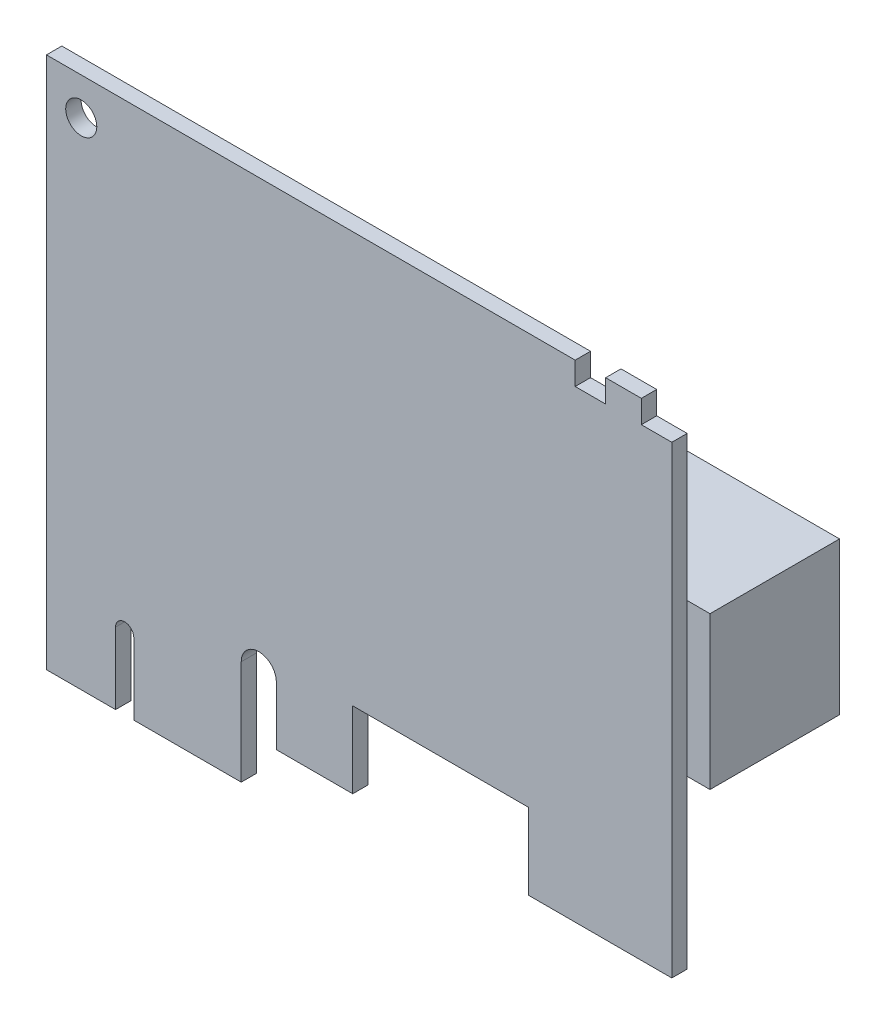
ISO-10303-21;
HEADER;
FILE_DESCRIPTION(('STEP AP214'),'2;1');
FILE_NAME('part.step','',(''),(''),'','','');
FILE_SCHEMA(('AUTOMOTIVE_DESIGN { 1 0 10303 214 1 1 1 1 }'));
ENDSEC;
DATA;
#1=APPLICATION_CONTEXT('core data for automotive mechanical design processes');
#2=APPLICATION_PROTOCOL_DEFINITION('international standard','automotive_design',2000,#1);
#3=PRODUCT_CONTEXT('',#1,'mechanical');
#4=PRODUCT('Part','Part','',(#3));
#5=PRODUCT_RELATED_PRODUCT_CATEGORY('part','',(#4));
#6=PRODUCT_DEFINITION_FORMATION('','',#4);
#7=PRODUCT_DEFINITION_CONTEXT('part definition',#1,'design');
#8=PRODUCT_DEFINITION('design','',#6,#7);
#9=PRODUCT_DEFINITION_SHAPE('','',#8);
#10=(LENGTH_UNIT() NAMED_UNIT(*) SI_UNIT(.MILLI.,.METRE.));
#11=(NAMED_UNIT(*) PLANE_ANGLE_UNIT() SI_UNIT($,.RADIAN.));
#12=(NAMED_UNIT(*) SI_UNIT($,.STERADIAN.) SOLID_ANGLE_UNIT());
#13=UNCERTAINTY_MEASURE_WITH_UNIT(LENGTH_MEASURE(1.E-05),#10,'distance_accuracy_value','');
#14=(GEOMETRIC_REPRESENTATION_CONTEXT(3) GLOBAL_UNCERTAINTY_ASSIGNED_CONTEXT((#13)) GLOBAL_UNIT_ASSIGNED_CONTEXT((#10,
#11,#12)) REPRESENTATION_CONTEXT('',''));
#15=CARTESIAN_POINT('',(0.,0.,0.));
#16=DIRECTION('',(0.,0.,1.));
#17=DIRECTION('',(1.,0.,0.));
#18=AXIS2_PLACEMENT_3D('',#15,#16,#17);
#19=CARTESIAN_POINT('',(22.1288,10.8712,0.));
#20=DIRECTION('',(0.,0.,1.));
#21=DIRECTION('',(1.,0.,0.));
#22=AXIS2_PLACEMENT_3D('',#19,#20,#21);
#23=PLANE('',#22);
#24=CARTESIAN_POINT('',(3.625,51.625,0.));
#25=DIRECTION('',(0.,0.,1.));
#26=DIRECTION('',(1.,0.,0.));
#27=AXIS2_PLACEMENT_3D('',#24,#25,#26);
#28=CIRCLE('',#27,1.61925);
#29=CARTESIAN_POINT('',(5.24425,51.625,0.));
#30=VERTEX_POINT('',#29);
#31=EDGE_CURVE('E241',#30,#30,#28,.T.);
#32=ORIENTED_EDGE('',*,*,#31,.T.);
#33=EDGE_LOOP('',(#32));
#34=FACE_BOUND('',#33,.T.);
#35=DIRECTION('',(1.,0.,0.));
#36=VECTOR('',#35,1.);
#37=CARTESIAN_POINT('',(67.55765,38.0375,0.));
#38=LINE('',#37,#36);
#39=CARTESIAN_POINT('',(45.33265,38.0375,0.));
#40=VERTEX_POINT('',#39);
#41=CARTESIAN_POINT('',(65.1764,38.0375,0.));
#42=VERTEX_POINT('',#41);
#43=EDGE_CURVE('E53',#40,#42,#38,.T.);
#44=ORIENTED_EDGE('',*,*,#43,.F.);
#45=DIRECTION('',(0.,1.,0.));
#46=VECTOR('',#45,1.);
#47=CARTESIAN_POINT('',(45.33265,38.0375,0.));
#48=LINE('',#47,#46);
#49=CARTESIAN_POINT('',(45.33265,22.1625,0.));
#50=VERTEX_POINT('',#49);
#51=EDGE_CURVE('E474',#50,#40,#48,.T.);
#52=ORIENTED_EDGE('',*,*,#51,.F.);
#53=DIRECTION('',(-1.,0.,0.));
#54=VECTOR('',#53,1.);
#55=CARTESIAN_POINT('',(67.55765,22.1625,0.));
#56=LINE('',#55,#54);
#57=CARTESIAN_POINT('',(65.1764,22.1625,0.));
#58=VERTEX_POINT('',#57);
#59=EDGE_CURVE('E11',#58,#50,#56,.T.);
#60=ORIENTED_EDGE('',*,*,#59,.F.);
#61=DIRECTION('',(0.,1.,0.));
#62=VECTOR('',#61,1.);
#63=CARTESIAN_POINT('',(65.1764,4.76250000000001,0.));
#64=LINE('',#63,#62);
#65=CARTESIAN_POINT('',(65.1764,4.76250000000001,0.));
#66=VERTEX_POINT('',#65);
#67=EDGE_CURVE('E328',#66,#58,#64,.T.);
#68=ORIENTED_EDGE('',*,*,#67,.F.);
#69=DIRECTION('',(1.,0.,0.));
#70=VECTOR('',#69,1.);
#71=CARTESIAN_POINT('',(50.2593,4.7625,0.));
#72=LINE('',#71,#70);
#73=CARTESIAN_POINT('',(50.2593,4.7625,0.));
#74=VERTEX_POINT('',#73);
#75=EDGE_CURVE('E326',#74,#66,#72,.T.);
#76=ORIENTED_EDGE('',*,*,#75,.F.);
#77=DIRECTION('',(0.,-1.,0.));
#78=VECTOR('',#77,1.);
#79=CARTESIAN_POINT('',(50.2593,4.7625,0.));
#80=LINE('',#79,#78);
#81=CARTESIAN_POINT('',(50.2593,12.7,0.));
#82=VERTEX_POINT('',#81);
#83=EDGE_CURVE('E324',#82,#74,#80,.T.);
#84=ORIENTED_EDGE('',*,*,#83,.F.);
#85=DIRECTION('',(1.,0.,0.));
#86=VECTOR('',#85,1.);
#87=CARTESIAN_POINT('',(31.9205,12.7,0.));
#88=LINE('',#87,#86);
#89=CARTESIAN_POINT('',(31.9205,12.7,0.));
#90=VERTEX_POINT('',#89);
#91=EDGE_CURVE('E322',#90,#82,#88,.T.);
#92=ORIENTED_EDGE('',*,*,#91,.F.);
#93=DIRECTION('',(0.,1.,0.));
#94=VECTOR('',#93,1.);
#95=CARTESIAN_POINT('',(31.9205,4.7625,0.));
#96=LINE('',#95,#94);
#97=CARTESIAN_POINT('',(31.9205,4.7625,0.));
#98=VERTEX_POINT('',#97);
#99=EDGE_CURVE('E320',#98,#90,#96,.T.);
#100=ORIENTED_EDGE('',*,*,#99,.F.);
#101=DIRECTION('',(1.,0.,0.));
#102=VECTOR('',#101,1.);
#103=CARTESIAN_POINT('',(31.9205,4.7625,0.));
#104=LINE('',#103,#102);
#105=CARTESIAN_POINT('',(23.9576,4.7625,0.));
#106=VERTEX_POINT('',#105);
#107=EDGE_CURVE('E318',#106,#98,#104,.T.);
#108=ORIENTED_EDGE('',*,*,#107,.F.);
#109=DIRECTION('',(0.,-1.,0.));
#110=VECTOR('',#109,1.);
#111=CARTESIAN_POINT('',(23.9576,4.7625,0.));
#112=LINE('',#111,#110);
#113=CARTESIAN_POINT('',(23.9576,10.8712,0.));
#114=VERTEX_POINT('',#113);
#115=EDGE_CURVE('E316',#114,#106,#112,.T.);
#116=ORIENTED_EDGE('',*,*,#115,.F.);
#117=CARTESIAN_POINT('',(22.1288,10.8712,0.));
#118=DIRECTION('',(0.,0.,-1.));
#119=DIRECTION('',(1.,0.,0.));
#120=AXIS2_PLACEMENT_3D('',#117,#118,#119);
#121=CIRCLE('',#120,1.8288);
#122=CARTESIAN_POINT('',(20.3,10.8712,0.));
#123=VERTEX_POINT('',#122);
#124=EDGE_CURVE('E314',#123,#114,#121,.T.);
#125=ORIENTED_EDGE('',*,*,#124,.F.);
#126=DIRECTION('',(0.,1.,0.));
#127=VECTOR('',#126,1.);
#128=CARTESIAN_POINT('',(20.3,0.,0.));
#129=LINE('',#128,#127);
#130=CARTESIAN_POINT('',(20.3,0.,0.));
#131=VERTEX_POINT('',#130);
#132=EDGE_CURVE('E312',#131,#123,#129,.T.);
#133=ORIENTED_EDGE('',*,*,#132,.F.);
#134=DIRECTION('',(1.,0.,0.));
#135=VECTOR('',#134,1.);
#136=CARTESIAN_POINT('',(9.1,0.,0.));
#137=LINE('',#136,#135);
#138=CARTESIAN_POINT('',(9.1,0.,0.));
#139=VERTEX_POINT('',#138);
#140=EDGE_CURVE('E310',#139,#131,#137,.T.);
#141=ORIENTED_EDGE('',*,*,#140,.F.);
#142=DIRECTION('',(0.,-1.,0.));
#143=VECTOR('',#142,1.);
#144=CARTESIAN_POINT('',(9.1,0.,0.));
#145=LINE('',#144,#143);
#146=CARTESIAN_POINT('',(9.1,7.45,0.));
#147=VERTEX_POINT('',#146);
#148=EDGE_CURVE('E308',#147,#139,#145,.T.);
#149=ORIENTED_EDGE('',*,*,#148,.F.);
#150=CARTESIAN_POINT('',(8.15,7.45,0.));
#151=DIRECTION('',(0.,0.,-1.));
#152=DIRECTION('',(1.,0.,0.));
#153=AXIS2_PLACEMENT_3D('',#150,#151,#152);
#154=CIRCLE('',#153,0.95);
#155=CARTESIAN_POINT('',(7.2,7.45,0.));
#156=VERTEX_POINT('',#155);
#157=EDGE_CURVE('E306',#156,#147,#154,.T.);
#158=ORIENTED_EDGE('',*,*,#157,.F.);
#159=DIRECTION('',(0.,1.,0.));
#160=VECTOR('',#159,1.);
#161=CARTESIAN_POINT('',(7.2,0.,0.));
#162=LINE('',#161,#160);
#163=CARTESIAN_POINT('',(7.2,0.,0.));
#164=VERTEX_POINT('',#163);
#165=EDGE_CURVE('E304',#164,#156,#162,.T.);
#166=ORIENTED_EDGE('',*,*,#165,.F.);
#167=DIRECTION('',(1.,0.,0.));
#168=VECTOR('',#167,1.);
#169=CARTESIAN_POINT('',(0.,0.,0.));
#170=LINE('',#169,#168);
#171=CARTESIAN_POINT('',(0.,0.,0.));
#172=VERTEX_POINT('',#171);
#173=EDGE_CURVE('E302',#172,#164,#170,.T.);
#174=ORIENTED_EDGE('',*,*,#173,.F.);
#175=DIRECTION('',(0.,-1.,0.));
#176=VECTOR('',#175,1.);
#177=CARTESIAN_POINT('',(0.,0.,0.));
#178=LINE('',#177,#176);
#179=CARTESIAN_POINT('',(0.,55.5,0.));
#180=VERTEX_POINT('',#179);
#181=EDGE_CURVE('E251',#180,#172,#178,.T.);
#182=ORIENTED_EDGE('',*,*,#181,.F.);
#183=DIRECTION('',(-1.,0.,0.));
#184=VECTOR('',#183,1.);
#185=CARTESIAN_POINT('',(0.,55.5,0.));
#186=LINE('',#185,#184);
#187=CARTESIAN_POINT('',(55.1064,55.5,0.));
#188=VERTEX_POINT('',#187);
#189=EDGE_CURVE('E257',#188,#180,#186,.T.);
#190=ORIENTED_EDGE('',*,*,#189,.F.);
#191=DIRECTION('',(0.,1.,0.));
#192=VECTOR('',#191,1.);
#193=CARTESIAN_POINT('',(55.1064,55.5,0.));
#194=LINE('',#193,#192);
#195=CARTESIAN_POINT('',(55.1064,53.11875,0.));
#196=VERTEX_POINT('',#195);
#197=EDGE_CURVE('E342',#196,#188,#194,.T.);
#198=ORIENTED_EDGE('',*,*,#197,.F.);
#199=DIRECTION('',(-1.,0.,0.));
#200=VECTOR('',#199,1.);
#201=CARTESIAN_POINT('',(55.1064,53.11875,0.));
#202=LINE('',#201,#200);
#203=CARTESIAN_POINT('',(58.2814,53.11875,0.));
#204=VERTEX_POINT('',#203);
#205=EDGE_CURVE('E340',#204,#196,#202,.T.);
#206=ORIENTED_EDGE('',*,*,#205,.F.);
#207=DIRECTION('',(0.,-1.,0.));
#208=VECTOR('',#207,1.);
#209=CARTESIAN_POINT('',(58.2814,55.5,0.));
#210=LINE('',#209,#208);
#211=CARTESIAN_POINT('',(58.2814,55.5,0.));
#212=VERTEX_POINT('',#211);
#213=EDGE_CURVE('E338',#212,#204,#210,.T.);
#214=ORIENTED_EDGE('',*,*,#213,.F.);
#215=DIRECTION('',(-1.,0.,0.));
#216=VECTOR('',#215,1.);
#217=CARTESIAN_POINT('',(58.2814,55.5,0.));
#218=LINE('',#217,#216);
#219=CARTESIAN_POINT('',(62.0014,55.5,0.));
#220=VERTEX_POINT('',#219);
#221=EDGE_CURVE('E336',#220,#212,#218,.T.);
#222=ORIENTED_EDGE('',*,*,#221,.F.);
#223=DIRECTION('',(0.,1.,0.));
#224=VECTOR('',#223,1.);
#225=CARTESIAN_POINT('',(62.0014,55.5,0.));
#226=LINE('',#225,#224);
#227=CARTESIAN_POINT('',(62.0014,53.11875,0.));
#228=VERTEX_POINT('',#227);
#229=EDGE_CURVE('E334',#228,#220,#226,.T.);
#230=ORIENTED_EDGE('',*,*,#229,.F.);
#231=DIRECTION('',(-1.,0.,0.));
#232=VECTOR('',#231,1.);
#233=CARTESIAN_POINT('',(62.0014,53.11875,0.));
#234=LINE('',#233,#232);
#235=CARTESIAN_POINT('',(65.1764,53.11875,0.));
#236=VERTEX_POINT('',#235);
#237=EDGE_CURVE('E331',#236,#228,#234,.T.);
#238=ORIENTED_EDGE('',*,*,#237,.F.);
#239=EDGE_CURVE('E58',#42,#236,#64,.T.);
#240=ORIENTED_EDGE('',*,*,#239,.F.);
#241=EDGE_LOOP('',(#44,#52,#60,#68,#76,#84,#92,#100,#108,#116,#125,#133,#141,#149,#158,#166,
#174,#182,#190,#198,#206,#214,#222,#230,#238,#240));
#242=FACE_BOUND('',#241,.T.);
#243=ADVANCED_FACE('F36',(#34,#242),#23,.F.);
#244=CARTESIAN_POINT('',(22.1288,10.8712,1.6));
#245=DIRECTION('',(0.,0.,1.));
#246=DIRECTION('',(1.,0.,0.));
#247=AXIS2_PLACEMENT_3D('',#244,#245,#246);
#248=PLANE('',#247);
#249=DIRECTION('',(0.,-1.,0.));
#250=VECTOR('',#249,1.);
#251=CARTESIAN_POINT('',(0.,0.,1.6));
#252=LINE('',#251,#250);
#253=CARTESIAN_POINT('',(0.,55.5,1.6));
#254=VERTEX_POINT('',#253);
#255=CARTESIAN_POINT('',(0.,0.,1.6));
#256=VERTEX_POINT('',#255);
#257=EDGE_CURVE('E253',#254,#256,#252,.T.);
#258=ORIENTED_EDGE('',*,*,#257,.T.);
#259=DIRECTION('',(1.,0.,0.));
#260=VECTOR('',#259,1.);
#261=CARTESIAN_POINT('',(0.,0.,1.6));
#262=LINE('',#261,#260);
#263=CARTESIAN_POINT('',(7.2,0.,1.6));
#264=VERTEX_POINT('',#263);
#265=EDGE_CURVE('E256',#256,#264,#262,.T.);
#266=ORIENTED_EDGE('',*,*,#265,.T.);
#267=DIRECTION('',(0.,1.,0.));
#268=VECTOR('',#267,1.);
#269=CARTESIAN_POINT('',(7.2,0.,1.6));
#270=LINE('',#269,#268);
#271=CARTESIAN_POINT('',(7.2,7.45,1.6));
#272=VERTEX_POINT('',#271);
#273=EDGE_CURVE('E259',#264,#272,#270,.T.);
#274=ORIENTED_EDGE('',*,*,#273,.T.);
#275=CARTESIAN_POINT('',(8.15,7.45,1.6));
#276=DIRECTION('',(0.,0.,-1.));
#277=DIRECTION('',(1.,0.,0.));
#278=AXIS2_PLACEMENT_3D('',#275,#276,#277);
#279=CIRCLE('',#278,0.95);
#280=CARTESIAN_POINT('',(9.1,7.45,1.6));
#281=VERTEX_POINT('',#280);
#282=EDGE_CURVE('E261',#272,#281,#279,.T.);
#283=ORIENTED_EDGE('',*,*,#282,.T.);
#284=DIRECTION('',(0.,-1.,0.));
#285=VECTOR('',#284,1.);
#286=CARTESIAN_POINT('',(9.1,0.,1.6));
#287=LINE('',#286,#285);
#288=CARTESIAN_POINT('',(9.1,0.,1.6));
#289=VERTEX_POINT('',#288);
#290=EDGE_CURVE('E263',#281,#289,#287,.T.);
#291=ORIENTED_EDGE('',*,*,#290,.T.);
#292=DIRECTION('',(1.,0.,0.));
#293=VECTOR('',#292,1.);
#294=CARTESIAN_POINT('',(9.1,0.,1.6));
#295=LINE('',#294,#293);
#296=CARTESIAN_POINT('',(20.3,0.,1.6));
#297=VERTEX_POINT('',#296);
#298=EDGE_CURVE('E265',#289,#297,#295,.T.);
#299=ORIENTED_EDGE('',*,*,#298,.T.);
#300=DIRECTION('',(0.,1.,0.));
#301=VECTOR('',#300,1.);
#302=CARTESIAN_POINT('',(20.3,0.,1.6));
#303=LINE('',#302,#301);
#304=CARTESIAN_POINT('',(20.3,10.8712,1.6));
#305=VERTEX_POINT('',#304);
#306=EDGE_CURVE('E267',#297,#305,#303,.T.);
#307=ORIENTED_EDGE('',*,*,#306,.T.);
#308=CARTESIAN_POINT('',(22.1288,10.8712,1.6));
#309=DIRECTION('',(0.,0.,-1.));
#310=DIRECTION('',(1.,0.,0.));
#311=AXIS2_PLACEMENT_3D('',#308,#309,#310);
#312=CIRCLE('',#311,1.8288);
#313=CARTESIAN_POINT('',(23.9576,10.8712,1.6));
#314=VERTEX_POINT('',#313);
#315=EDGE_CURVE('E269',#305,#314,#312,.T.);
#316=ORIENTED_EDGE('',*,*,#315,.T.);
#317=DIRECTION('',(0.,-1.,0.));
#318=VECTOR('',#317,1.);
#319=CARTESIAN_POINT('',(23.9576,4.7625,1.6));
#320=LINE('',#319,#318);
#321=CARTESIAN_POINT('',(23.9576,4.7625,1.6));
#322=VERTEX_POINT('',#321);
#323=EDGE_CURVE('E271',#314,#322,#320,.T.);
#324=ORIENTED_EDGE('',*,*,#323,.T.);
#325=DIRECTION('',(1.,0.,0.));
#326=VECTOR('',#325,1.);
#327=CARTESIAN_POINT('',(31.9205,4.7625,1.6));
#328=LINE('',#327,#326);
#329=CARTESIAN_POINT('',(31.9205,4.7625,1.6));
#330=VERTEX_POINT('',#329);
#331=EDGE_CURVE('E273',#322,#330,#328,.T.);
#332=ORIENTED_EDGE('',*,*,#331,.T.);
#333=DIRECTION('',(0.,1.,0.));
#334=VECTOR('',#333,1.);
#335=CARTESIAN_POINT('',(31.9205,4.7625,1.6));
#336=LINE('',#335,#334);
#337=CARTESIAN_POINT('',(31.9205,12.7,1.6));
#338=VERTEX_POINT('',#337);
#339=EDGE_CURVE('E275',#330,#338,#336,.T.);
#340=ORIENTED_EDGE('',*,*,#339,.T.);
#341=DIRECTION('',(1.,0.,0.));
#342=VECTOR('',#341,1.);
#343=CARTESIAN_POINT('',(31.9205,12.7,1.6));
#344=LINE('',#343,#342);
#345=CARTESIAN_POINT('',(50.2593,12.7,1.6));
#346=VERTEX_POINT('',#345);
#347=EDGE_CURVE('E277',#338,#346,#344,.T.);
#348=ORIENTED_EDGE('',*,*,#347,.T.);
#349=DIRECTION('',(0.,-1.,0.));
#350=VECTOR('',#349,1.);
#351=CARTESIAN_POINT('',(50.2593,4.7625,1.6));
#352=LINE('',#351,#350);
#353=CARTESIAN_POINT('',(50.2593,4.7625,1.6));
#354=VERTEX_POINT('',#353);
#355=EDGE_CURVE('E279',#346,#354,#352,.T.);
#356=ORIENTED_EDGE('',*,*,#355,.T.);
#357=DIRECTION('',(1.,0.,0.));
#358=VECTOR('',#357,1.);
#359=CARTESIAN_POINT('',(50.2593,4.7625,1.6));
#360=LINE('',#359,#358);
#361=CARTESIAN_POINT('',(65.1764,4.76250000000001,1.6));
#362=VERTEX_POINT('',#361);
#363=EDGE_CURVE('E281',#354,#362,#360,.T.);
#364=ORIENTED_EDGE('',*,*,#363,.T.);
#365=DIRECTION('',(0.,1.,0.));
#366=VECTOR('',#365,1.);
#367=CARTESIAN_POINT('',(65.1764,4.76250000000001,1.6));
#368=LINE('',#367,#366);
#369=CARTESIAN_POINT('',(65.1764,53.11875,1.6));
#370=VERTEX_POINT('',#369);
#371=EDGE_CURVE('E283',#362,#370,#368,.T.);
#372=ORIENTED_EDGE('',*,*,#371,.T.);
#373=DIRECTION('',(-1.,0.,0.));
#374=VECTOR('',#373,1.);
#375=CARTESIAN_POINT('',(62.0014,53.11875,1.6));
#376=LINE('',#375,#374);
#377=CARTESIAN_POINT('',(62.0014,53.11875,1.6));
#378=VERTEX_POINT('',#377);
#379=EDGE_CURVE('E285',#370,#378,#376,.T.);
#380=ORIENTED_EDGE('',*,*,#379,.T.);
#381=DIRECTION('',(0.,1.,0.));
#382=VECTOR('',#381,1.);
#383=CARTESIAN_POINT('',(62.0014,55.5,1.6));
#384=LINE('',#383,#382);
#385=CARTESIAN_POINT('',(62.0014,55.5,1.6));
#386=VERTEX_POINT('',#385);
#387=EDGE_CURVE('E287',#378,#386,#384,.T.);
#388=ORIENTED_EDGE('',*,*,#387,.T.);
#389=DIRECTION('',(-1.,0.,0.));
#390=VECTOR('',#389,1.);
#391=CARTESIAN_POINT('',(58.2814,55.5,1.6));
#392=LINE('',#391,#390);
#393=CARTESIAN_POINT('',(58.2814,55.5,1.6));
#394=VERTEX_POINT('',#393);
#395=EDGE_CURVE('E289',#386,#394,#392,.T.);
#396=ORIENTED_EDGE('',*,*,#395,.T.);
#397=DIRECTION('',(0.,-1.,0.));
#398=VECTOR('',#397,1.);
#399=CARTESIAN_POINT('',(58.2814,55.5,1.6));
#400=LINE('',#399,#398);
#401=CARTESIAN_POINT('',(58.2814,53.11875,1.6));
#402=VERTEX_POINT('',#401);
#403=EDGE_CURVE('E291',#394,#402,#400,.T.);
#404=ORIENTED_EDGE('',*,*,#403,.T.);
#405=DIRECTION('',(-1.,0.,0.));
#406=VECTOR('',#405,1.);
#407=CARTESIAN_POINT('',(55.1064,53.11875,1.6));
#408=LINE('',#407,#406);
#409=CARTESIAN_POINT('',(55.1064,53.11875,1.6));
#410=VERTEX_POINT('',#409);
#411=EDGE_CURVE('E293',#402,#410,#408,.T.);
#412=ORIENTED_EDGE('',*,*,#411,.T.);
#413=DIRECTION('',(0.,1.,0.));
#414=VECTOR('',#413,1.);
#415=CARTESIAN_POINT('',(55.1064,55.5,1.6));
#416=LINE('',#415,#414);
#417=CARTESIAN_POINT('',(55.1064,55.5,1.6));
#418=VERTEX_POINT('',#417);
#419=EDGE_CURVE('E295',#410,#418,#416,.T.);
#420=ORIENTED_EDGE('',*,*,#419,.T.);
#421=DIRECTION('',(-1.,0.,0.));
#422=VECTOR('',#421,1.);
#423=CARTESIAN_POINT('',(0.,55.5,1.6));
#424=LINE('',#423,#422);
#425=EDGE_CURVE('E297',#418,#254,#424,.T.);
#426=ORIENTED_EDGE('',*,*,#425,.T.);
#427=EDGE_LOOP('',(#258,#266,#274,#283,#291,#299,#307,#316,#324,#332,#340,#348,#356,#364,#372,
#380,#388,#396,#404,#412,#420,#426));
#428=FACE_BOUND('',#427,.T.);
#429=CARTESIAN_POINT('',(3.625,51.625,1.6));
#430=DIRECTION('',(0.,0.,1.));
#431=DIRECTION('',(1.,0.,0.));
#432=AXIS2_PLACEMENT_3D('',#429,#430,#431);
#433=CIRCLE('',#432,1.61925);
#434=CARTESIAN_POINT('',(5.24425,51.625,1.6));
#435=VERTEX_POINT('',#434);
#436=EDGE_CURVE('E244',#435,#435,#433,.T.);
#437=ORIENTED_EDGE('',*,*,#436,.F.);
#438=EDGE_LOOP('',(#437));
#439=FACE_BOUND('',#438,.T.);
#440=ADVANCED_FACE('F429',(#428,#439),#248,.T.);
#441=CARTESIAN_POINT('',(0.,0.,1.6));
#442=DIRECTION('',(1.,0.,0.));
#443=DIRECTION('',(0.,0.,-1.));
#444=AXIS2_PLACEMENT_3D('',#441,#442,#443);
#445=PLANE('',#444);
#446=ORIENTED_EDGE('',*,*,#181,.T.);
#447=DIRECTION('',(0.,0.,-1.));
#448=VECTOR('',#447,1.);
#449=CARTESIAN_POINT('',(0.,0.,1.6));
#450=LINE('',#449,#448);
#451=EDGE_CURVE('E40',#256,#172,#450,.T.);
#452=ORIENTED_EDGE('',*,*,#451,.F.);
#453=ORIENTED_EDGE('',*,*,#257,.F.);
#454=DIRECTION('',(0.,0.,-1.));
#455=VECTOR('',#454,1.);
#456=CARTESIAN_POINT('',(0.,55.5,1.6));
#457=LINE('',#456,#455);
#458=EDGE_CURVE('E299',#254,#180,#457,.T.);
#459=ORIENTED_EDGE('',*,*,#458,.T.);
#460=EDGE_LOOP('',(#446,#452,#453,#459));
#461=FACE_BOUND('',#460,.T.);
#462=ADVANCED_FACE('F38',(#461),#445,.F.);
#463=CARTESIAN_POINT('',(0.,0.,1.6));
#464=DIRECTION('',(0.,1.,0.));
#465=DIRECTION('',(0.,0.,1.));
#466=AXIS2_PLACEMENT_3D('',#463,#464,#465);
#467=PLANE('',#466);
#468=ORIENTED_EDGE('',*,*,#173,.T.);
#469=DIRECTION('',(0.,0.,-1.));
#470=VECTOR('',#469,1.);
#471=CARTESIAN_POINT('',(7.2,0.,1.6));
#472=LINE('',#471,#470);
#473=EDGE_CURVE('E403',#264,#164,#472,.T.);
#474=ORIENTED_EDGE('',*,*,#473,.F.);
#475=ORIENTED_EDGE('',*,*,#265,.F.);
#476=ORIENTED_EDGE('',*,*,#451,.T.);
#477=EDGE_LOOP('',(#468,#474,#475,#476));
#478=FACE_BOUND('',#477,.T.);
#479=ADVANCED_FACE('F412',(#478),#467,.F.);
#480=CARTESIAN_POINT('',(7.2,0.,1.6));
#481=DIRECTION('',(-1.,0.,0.));
#482=DIRECTION('',(0.,0.,1.));
#483=AXIS2_PLACEMENT_3D('',#480,#481,#482);
#484=PLANE('',#483);
#485=ORIENTED_EDGE('',*,*,#165,.T.);
#486=DIRECTION('',(0.,0.,-1.));
#487=VECTOR('',#486,1.);
#488=CARTESIAN_POINT('',(7.2,7.45,1.6));
#489=LINE('',#488,#487);
#490=EDGE_CURVE('E401',#272,#156,#489,.T.);
#491=ORIENTED_EDGE('',*,*,#490,.F.);
#492=ORIENTED_EDGE('',*,*,#273,.F.);
#493=ORIENTED_EDGE('',*,*,#473,.T.);
#494=EDGE_LOOP('',(#485,#491,#492,#493));
#495=FACE_BOUND('',#494,.T.);
#496=ADVANCED_FACE('F422',(#495),#484,.F.);
#497=CARTESIAN_POINT('',(8.15,7.45,1.6));
#498=DIRECTION('',(0.,0.,-1.));
#499=DIRECTION('',(-1.,0.,0.));
#500=AXIS2_PLACEMENT_3D('',#497,#498,#499);
#501=CYLINDRICAL_SURFACE('',#500,0.95);
#502=ORIENTED_EDGE('',*,*,#157,.T.);
#503=DIRECTION('',(0.,0.,-1.));
#504=VECTOR('',#503,1.);
#505=CARTESIAN_POINT('',(9.1,7.45,1.6));
#506=LINE('',#505,#504);
#507=EDGE_CURVE('E398',#281,#147,#506,.T.);
#508=ORIENTED_EDGE('',*,*,#507,.F.);
#509=ORIENTED_EDGE('',*,*,#282,.F.);
#510=ORIENTED_EDGE('',*,*,#490,.T.);
#511=EDGE_LOOP('',(#502,#508,#509,#510));
#512=FACE_BOUND('',#511,.T.);
#513=ADVANCED_FACE('F425',(#512),#501,.F.);
#514=CARTESIAN_POINT('',(9.1,0.,1.6));
#515=DIRECTION('',(1.,0.,0.));
#516=DIRECTION('',(0.,0.,-1.));
#517=AXIS2_PLACEMENT_3D('',#514,#515,#516);
#518=PLANE('',#517);
#519=ORIENTED_EDGE('',*,*,#148,.T.);
#520=DIRECTION('',(0.,0.,-1.));
#521=VECTOR('',#520,1.);
#522=CARTESIAN_POINT('',(9.1,0.,1.6));
#523=LINE('',#522,#521);
#524=EDGE_CURVE('E395',#289,#139,#523,.T.);
#525=ORIENTED_EDGE('',*,*,#524,.F.);
#526=ORIENTED_EDGE('',*,*,#290,.F.);
#527=ORIENTED_EDGE('',*,*,#507,.T.);
#528=EDGE_LOOP('',(#519,#525,#526,#527));
#529=FACE_BOUND('',#528,.T.);
#530=ADVANCED_FACE('F533',(#529),#518,.F.);
#531=CARTESIAN_POINT('',(9.1,0.,1.6));
#532=DIRECTION('',(0.,1.,0.));
#533=DIRECTION('',(0.,0.,1.));
#534=AXIS2_PLACEMENT_3D('',#531,#532,#533);
#535=PLANE('',#534);
#536=ORIENTED_EDGE('',*,*,#140,.T.);
#537=DIRECTION('',(0.,0.,-1.));
#538=VECTOR('',#537,1.);
#539=CARTESIAN_POINT('',(20.3,0.,1.6));
#540=LINE('',#539,#538);
#541=EDGE_CURVE('E392',#297,#131,#540,.T.);
#542=ORIENTED_EDGE('',*,*,#541,.F.);
#543=ORIENTED_EDGE('',*,*,#298,.F.);
#544=ORIENTED_EDGE('',*,*,#524,.T.);
#545=EDGE_LOOP('',(#536,#542,#543,#544));
#546=FACE_BOUND('',#545,.T.);
#547=ADVANCED_FACE('F531',(#546),#535,.F.);
#548=CARTESIAN_POINT('',(20.3,0.,1.6));
#549=DIRECTION('',(-1.,0.,0.));
#550=DIRECTION('',(0.,0.,1.));
#551=AXIS2_PLACEMENT_3D('',#548,#549,#550);
#552=PLANE('',#551);
#553=ORIENTED_EDGE('',*,*,#132,.T.);
#554=DIRECTION('',(0.,0.,-1.));
#555=VECTOR('',#554,1.);
#556=CARTESIAN_POINT('',(20.3,10.8712,1.6));
#557=LINE('',#556,#555);
#558=EDGE_CURVE('E389',#305,#123,#557,.T.);
#559=ORIENTED_EDGE('',*,*,#558,.F.);
#560=ORIENTED_EDGE('',*,*,#306,.F.);
#561=ORIENTED_EDGE('',*,*,#541,.T.);
#562=EDGE_LOOP('',(#553,#559,#560,#561));
#563=FACE_BOUND('',#562,.T.);
#564=ADVANCED_FACE('F527',(#563),#552,.F.);
#565=CARTESIAN_POINT('',(22.1288,10.8712,1.6));
#566=DIRECTION('',(0.,0.,-1.));
#567=DIRECTION('',(-1.,0.,0.));
#568=AXIS2_PLACEMENT_3D('',#565,#566,#567);
#569=CYLINDRICAL_SURFACE('',#568,1.8288);
#570=ORIENTED_EDGE('',*,*,#124,.T.);
#571=DIRECTION('',(0.,0.,-1.));
#572=VECTOR('',#571,1.);
#573=CARTESIAN_POINT('',(23.9576,10.8712,1.6));
#574=LINE('',#573,#572);
#575=EDGE_CURVE('E386',#314,#114,#574,.T.);
#576=ORIENTED_EDGE('',*,*,#575,.F.);
#577=ORIENTED_EDGE('',*,*,#315,.F.);
#578=ORIENTED_EDGE('',*,*,#558,.T.);
#579=EDGE_LOOP('',(#570,#576,#577,#578));
#580=FACE_BOUND('',#579,.T.);
#581=ADVANCED_FACE('F522',(#580),#569,.F.);
#582=CARTESIAN_POINT('',(23.9576,4.7625,1.6));
#583=DIRECTION('',(1.,0.,0.));
#584=DIRECTION('',(0.,1.,0.));
#585=AXIS2_PLACEMENT_3D('',#582,#583,#584);
#586=PLANE('',#585);
#587=ORIENTED_EDGE('',*,*,#115,.T.);
#588=DIRECTION('',(0.,0.,-1.));
#589=VECTOR('',#588,1.);
#590=CARTESIAN_POINT('',(23.9576,4.7625,1.6));
#591=LINE('',#590,#589);
#592=EDGE_CURVE('E383',#322,#106,#591,.T.);
#593=ORIENTED_EDGE('',*,*,#592,.F.);
#594=ORIENTED_EDGE('',*,*,#323,.F.);
#595=ORIENTED_EDGE('',*,*,#575,.T.);
#596=EDGE_LOOP('',(#587,#593,#594,#595));
#597=FACE_BOUND('',#596,.T.);
#598=ADVANCED_FACE('F516',(#597),#586,.F.);
#599=CARTESIAN_POINT('',(31.9205,4.7625,1.6));
#600=DIRECTION('',(0.,1.,0.));
#601=DIRECTION('',(-1.,0.,0.));
#602=AXIS2_PLACEMENT_3D('',#599,#600,#601);
#603=PLANE('',#602);
#604=ORIENTED_EDGE('',*,*,#107,.T.);
#605=DIRECTION('',(0.,0.,-1.));
#606=VECTOR('',#605,1.);
#607=CARTESIAN_POINT('',(31.9205,4.7625,1.6));
#608=LINE('',#607,#606);
#609=EDGE_CURVE('E380',#330,#98,#608,.T.);
#610=ORIENTED_EDGE('',*,*,#609,.F.);
#611=ORIENTED_EDGE('',*,*,#331,.F.);
#612=ORIENTED_EDGE('',*,*,#592,.T.);
#613=EDGE_LOOP('',(#604,#610,#611,#612));
#614=FACE_BOUND('',#613,.T.);
#615=ADVANCED_FACE('F512',(#614),#603,.F.);
#616=CARTESIAN_POINT('',(31.9205,4.7625,1.6));
#617=DIRECTION('',(-1.,0.,0.));
#618=DIRECTION('',(0.,0.,1.));
#619=AXIS2_PLACEMENT_3D('',#616,#617,#618);
#620=PLANE('',#619);
#621=ORIENTED_EDGE('',*,*,#99,.T.);
#622=DIRECTION('',(0.,0.,-1.));
#623=VECTOR('',#622,1.);
#624=CARTESIAN_POINT('',(31.9205,12.7,1.6));
#625=LINE('',#624,#623);
#626=EDGE_CURVE('E377',#338,#90,#625,.T.);
#627=ORIENTED_EDGE('',*,*,#626,.F.);
#628=ORIENTED_EDGE('',*,*,#339,.F.);
#629=ORIENTED_EDGE('',*,*,#609,.T.);
#630=EDGE_LOOP('',(#621,#627,#628,#629));
#631=FACE_BOUND('',#630,.T.);
#632=ADVANCED_FACE('F507',(#631),#620,.F.);
#633=CARTESIAN_POINT('',(31.9205,12.7,1.6));
#634=DIRECTION('',(0.,1.,0.));
#635=DIRECTION('',(0.,0.,1.));
#636=AXIS2_PLACEMENT_3D('',#633,#634,#635);
#637=PLANE('',#636);
#638=ORIENTED_EDGE('',*,*,#91,.T.);
#639=DIRECTION('',(0.,0.,-1.));
#640=VECTOR('',#639,1.);
#641=CARTESIAN_POINT('',(50.2593,12.7,1.6));
#642=LINE('',#641,#640);
#643=EDGE_CURVE('E374',#346,#82,#642,.T.);
#644=ORIENTED_EDGE('',*,*,#643,.F.);
#645=ORIENTED_EDGE('',*,*,#347,.F.);
#646=ORIENTED_EDGE('',*,*,#626,.T.);
#647=EDGE_LOOP('',(#638,#644,#645,#646));
#648=FACE_BOUND('',#647,.T.);
#649=ADVANCED_FACE('F501',(#648),#637,.F.);
#650=CARTESIAN_POINT('',(50.2593,4.7625,1.6));
#651=DIRECTION('',(1.,0.,0.));
#652=DIRECTION('',(0.,0.,-1.));
#653=AXIS2_PLACEMENT_3D('',#650,#651,#652);
#654=PLANE('',#653);
#655=ORIENTED_EDGE('',*,*,#83,.T.);
#656=DIRECTION('',(0.,0.,-1.));
#657=VECTOR('',#656,1.);
#658=CARTESIAN_POINT('',(50.2593,4.7625,1.6));
#659=LINE('',#658,#657);
#660=EDGE_CURVE('E371',#354,#74,#659,.T.);
#661=ORIENTED_EDGE('',*,*,#660,.F.);
#662=ORIENTED_EDGE('',*,*,#355,.F.);
#663=ORIENTED_EDGE('',*,*,#643,.T.);
#664=EDGE_LOOP('',(#655,#661,#662,#663));
#665=FACE_BOUND('',#664,.T.);
#666=ADVANCED_FACE('F497',(#665),#654,.F.);
#667=CARTESIAN_POINT('',(50.2593,4.7625,1.6));
#668=DIRECTION('',(0.,1.,0.));
#669=DIRECTION('',(-1.,0.,0.));
#670=AXIS2_PLACEMENT_3D('',#667,#668,#669);
#671=PLANE('',#670);
#672=ORIENTED_EDGE('',*,*,#75,.T.);
#673=DIRECTION('',(0.,0.,-1.));
#674=VECTOR('',#673,1.);
#675=CARTESIAN_POINT('',(65.1764,4.76250000000001,1.6));
#676=LINE('',#675,#674);
#677=EDGE_CURVE('E368',#362,#66,#676,.T.);
#678=ORIENTED_EDGE('',*,*,#677,.F.);
#679=ORIENTED_EDGE('',*,*,#363,.F.);
#680=ORIENTED_EDGE('',*,*,#660,.T.);
#681=EDGE_LOOP('',(#672,#678,#679,#680));
#682=FACE_BOUND('',#681,.T.);
#683=ADVANCED_FACE('F492',(#682),#671,.F.);
#684=CARTESIAN_POINT('',(65.1764,4.76250000000001,1.6));
#685=DIRECTION('',(-1.,0.,0.));
#686=DIRECTION('',(0.,0.,1.));
#687=AXIS2_PLACEMENT_3D('',#684,#685,#686);
#688=PLANE('',#687);
#689=ORIENTED_EDGE('',*,*,#67,.T.);
#690=EDGE_CURVE('E332',#58,#42,#64,.T.);
#691=ORIENTED_EDGE('',*,*,#690,.T.);
#692=ORIENTED_EDGE('',*,*,#239,.T.);
#693=DIRECTION('',(0.,0.,-1.));
#694=VECTOR('',#693,1.);
#695=CARTESIAN_POINT('',(65.1764,53.11875,1.6));
#696=LINE('',#695,#694);
#697=EDGE_CURVE('E365',#370,#236,#696,.T.);
#698=ORIENTED_EDGE('',*,*,#697,.F.);
#699=ORIENTED_EDGE('',*,*,#371,.F.);
#700=ORIENTED_EDGE('',*,*,#677,.T.);
#701=EDGE_LOOP('',(#689,#691,#692,#698,#699,#700));
#702=FACE_BOUND('',#701,.T.);
#703=ADVANCED_FACE('F466',(#702),#688,.F.);
#704=CARTESIAN_POINT('',(62.0014,53.11875,1.6));
#705=DIRECTION('',(0.,-1.,0.));
#706=DIRECTION('',(0.,0.,-1.));
#707=AXIS2_PLACEMENT_3D('',#704,#705,#706);
#708=PLANE('',#707);
#709=ORIENTED_EDGE('',*,*,#237,.T.);
#710=DIRECTION('',(0.,0.,-1.));
#711=VECTOR('',#710,1.);
#712=CARTESIAN_POINT('',(62.0014,53.11875,1.6));
#713=LINE('',#712,#711);
#714=EDGE_CURVE('E362',#378,#228,#713,.T.);
#715=ORIENTED_EDGE('',*,*,#714,.F.);
#716=ORIENTED_EDGE('',*,*,#379,.F.);
#717=ORIENTED_EDGE('',*,*,#697,.T.);
#718=EDGE_LOOP('',(#709,#715,#716,#717));
#719=FACE_BOUND('',#718,.T.);
#720=ADVANCED_FACE('F462',(#719),#708,.F.);
#721=CARTESIAN_POINT('',(62.0014,55.5,1.6));
#722=DIRECTION('',(-1.,0.,0.));
#723=DIRECTION('',(0.,0.,1.));
#724=AXIS2_PLACEMENT_3D('',#721,#722,#723);
#725=PLANE('',#724);
#726=ORIENTED_EDGE('',*,*,#229,.T.);
#727=DIRECTION('',(0.,0.,-1.));
#728=VECTOR('',#727,1.);
#729=CARTESIAN_POINT('',(62.0014,55.5,1.6));
#730=LINE('',#729,#728);
#731=EDGE_CURVE('E359',#386,#220,#730,.T.);
#732=ORIENTED_EDGE('',*,*,#731,.F.);
#733=ORIENTED_EDGE('',*,*,#387,.F.);
#734=ORIENTED_EDGE('',*,*,#714,.T.);
#735=EDGE_LOOP('',(#726,#732,#733,#734));
#736=FACE_BOUND('',#735,.T.);
#737=ADVANCED_FACE('F457',(#736),#725,.F.);
#738=CARTESIAN_POINT('',(58.2814,55.5,1.6));
#739=DIRECTION('',(0.,-1.,0.));
#740=DIRECTION('',(0.,0.,-1.));
#741=AXIS2_PLACEMENT_3D('',#738,#739,#740);
#742=PLANE('',#741);
#743=ORIENTED_EDGE('',*,*,#221,.T.);
#744=DIRECTION('',(0.,0.,-1.));
#745=VECTOR('',#744,1.);
#746=CARTESIAN_POINT('',(58.2814,55.5,1.6));
#747=LINE('',#746,#745);
#748=EDGE_CURVE('E356',#394,#212,#747,.T.);
#749=ORIENTED_EDGE('',*,*,#748,.F.);
#750=ORIENTED_EDGE('',*,*,#395,.F.);
#751=ORIENTED_EDGE('',*,*,#731,.T.);
#752=EDGE_LOOP('',(#743,#749,#750,#751));
#753=FACE_BOUND('',#752,.T.);
#754=ADVANCED_FACE('F453',(#753),#742,.F.);
#755=CARTESIAN_POINT('',(58.2814,55.5,1.6));
#756=DIRECTION('',(1.,0.,0.));
#757=DIRECTION('',(0.,0.,-1.));
#758=AXIS2_PLACEMENT_3D('',#755,#756,#757);
#759=PLANE('',#758);
#760=ORIENTED_EDGE('',*,*,#213,.T.);
#761=DIRECTION('',(0.,0.,-1.));
#762=VECTOR('',#761,1.);
#763=CARTESIAN_POINT('',(58.2814,53.11875,1.6));
#764=LINE('',#763,#762);
#765=EDGE_CURVE('E353',#402,#204,#764,.T.);
#766=ORIENTED_EDGE('',*,*,#765,.F.);
#767=ORIENTED_EDGE('',*,*,#403,.F.);
#768=ORIENTED_EDGE('',*,*,#748,.T.);
#769=EDGE_LOOP('',(#760,#766,#767,#768));
#770=FACE_BOUND('',#769,.T.);
#771=ADVANCED_FACE('F449',(#770),#759,.F.);
#772=CARTESIAN_POINT('',(55.1064,53.11875,1.6));
#773=DIRECTION('',(0.,-1.,0.));
#774=DIRECTION('',(0.,0.,-1.));
#775=AXIS2_PLACEMENT_3D('',#772,#773,#774);
#776=PLANE('',#775);
#777=ORIENTED_EDGE('',*,*,#205,.T.);
#778=DIRECTION('',(0.,0.,-1.));
#779=VECTOR('',#778,1.);
#780=CARTESIAN_POINT('',(55.1064,53.11875,1.6));
#781=LINE('',#780,#779);
#782=EDGE_CURVE('E350',#410,#196,#781,.T.);
#783=ORIENTED_EDGE('',*,*,#782,.F.);
#784=ORIENTED_EDGE('',*,*,#411,.F.);
#785=ORIENTED_EDGE('',*,*,#765,.T.);
#786=EDGE_LOOP('',(#777,#783,#784,#785));
#787=FACE_BOUND('',#786,.T.);
#788=ADVANCED_FACE('F444',(#787),#776,.F.);
#789=CARTESIAN_POINT('',(55.1064,55.5,1.6));
#790=DIRECTION('',(-1.,0.,0.));
#791=DIRECTION('',(0.,0.,1.));
#792=AXIS2_PLACEMENT_3D('',#789,#790,#791);
#793=PLANE('',#792);
#794=ORIENTED_EDGE('',*,*,#197,.T.);
#795=DIRECTION('',(0.,0.,-1.));
#796=VECTOR('',#795,1.);
#797=CARTESIAN_POINT('',(55.1064,55.5,1.6));
#798=LINE('',#797,#796);
#799=EDGE_CURVE('E347',#418,#188,#798,.T.);
#800=ORIENTED_EDGE('',*,*,#799,.F.);
#801=ORIENTED_EDGE('',*,*,#419,.F.);
#802=ORIENTED_EDGE('',*,*,#782,.T.);
#803=EDGE_LOOP('',(#794,#800,#801,#802));
#804=FACE_BOUND('',#803,.T.);
#805=ADVANCED_FACE('F438',(#804),#793,.F.);
#806=CARTESIAN_POINT('',(0.,55.5,1.6));
#807=DIRECTION('',(0.,-1.,0.));
#808=DIRECTION('',(0.,0.,-1.));
#809=AXIS2_PLACEMENT_3D('',#806,#807,#808);
#810=PLANE('',#809);
#811=ORIENTED_EDGE('',*,*,#189,.T.);
#812=ORIENTED_EDGE('',*,*,#458,.F.);
#813=ORIENTED_EDGE('',*,*,#425,.F.);
#814=ORIENTED_EDGE('',*,*,#799,.T.);
#815=EDGE_LOOP('',(#811,#812,#813,#814));
#816=FACE_BOUND('',#815,.T.);
#817=ADVANCED_FACE('F436',(#816),#810,.F.);
#818=CARTESIAN_POINT('',(3.625,51.625,1.6));
#819=DIRECTION('',(0.,0.,-1.));
#820=DIRECTION('',(-1.,0.,0.));
#821=AXIS2_PLACEMENT_3D('',#818,#819,#820);
#822=CYLINDRICAL_SURFACE('',#821,1.61925);
#823=ORIENTED_EDGE('',*,*,#436,.T.);
#824=EDGE_LOOP('',(#823));
#825=FACE_BOUND('',#824,.T.);
#826=ORIENTED_EDGE('',*,*,#31,.F.);
#827=EDGE_LOOP('',(#826));
#828=FACE_BOUND('',#827,.T.);
#829=ADVANCED_FACE('F553',(#825,#828),#822,.F.);
#830=CARTESIAN_POINT('',(67.55765,38.0375,-13.5));
#831=DIRECTION('',(-1.,0.,0.));
#832=DIRECTION('',(0.,0.,1.));
#833=AXIS2_PLACEMENT_3D('',#830,#831,#832);
#834=PLANE('',#833);
#835=DIRECTION('',(0.,-1.,0.));
#836=VECTOR('',#835,1.);
#837=CARTESIAN_POINT('',(67.55765,38.0375,0.));
#838=LINE('',#837,#836);
#839=CARTESIAN_POINT('',(67.55765,38.0375,0.));
#840=VERTEX_POINT('',#839);
#841=CARTESIAN_POINT('',(67.55765,22.1625,0.));
#842=VERTEX_POINT('',#841);
#843=EDGE_CURVE('E240',#840,#842,#838,.T.);
#844=ORIENTED_EDGE('',*,*,#843,.T.);
#845=DIRECTION('',(0.,0.,1.));
#846=VECTOR('',#845,1.);
#847=CARTESIAN_POINT('',(67.55765,22.1625,-13.5));
#848=LINE('',#847,#846);
#849=CARTESIAN_POINT('',(67.55765,22.1625,-13.5));
#850=VERTEX_POINT('',#849);
#851=EDGE_CURVE('E221',#850,#842,#848,.T.);
#852=ORIENTED_EDGE('',*,*,#851,.F.);
#853=DIRECTION('',(0.,-1.,0.));
#854=VECTOR('',#853,1.);
#855=CARTESIAN_POINT('',(67.55765,38.0375,-13.5));
#856=LINE('',#855,#854);
#857=CARTESIAN_POINT('',(67.55765,38.0375,-13.5));
#858=VERTEX_POINT('',#857);
#859=EDGE_CURVE('E228',#858,#850,#856,.T.);
#860=ORIENTED_EDGE('',*,*,#859,.F.);
#861=DIRECTION('',(0.,0.,1.));
#862=VECTOR('',#861,1.);
#863=CARTESIAN_POINT('',(67.55765,38.0375,-13.5));
#864=LINE('',#863,#862);
#865=EDGE_CURVE('E481',#858,#840,#864,.T.);
#866=ORIENTED_EDGE('',*,*,#865,.T.);
#867=EDGE_LOOP('',(#844,#852,#860,#866));
#868=FACE_BOUND('',#867,.T.);
#869=ADVANCED_FACE('F238',(#868),#834,.F.);
#870=CARTESIAN_POINT('',(67.55765,22.1625,-13.5));
#871=DIRECTION('',(0.,1.,0.));
#872=DIRECTION('',(0.,0.,1.));
#873=AXIS2_PLACEMENT_3D('',#870,#871,#872);
#874=PLANE('',#873);
#875=EDGE_CURVE('E46',#842,#58,#56,.T.);
#876=ORIENTED_EDGE('',*,*,#875,.T.);
#877=ORIENTED_EDGE('',*,*,#59,.T.);
#878=DIRECTION('',(0.,0.,1.));
#879=VECTOR('',#878,1.);
#880=CARTESIAN_POINT('',(45.33265,22.1625,-13.5));
#881=LINE('',#880,#879);
#882=CARTESIAN_POINT('',(45.33265,22.1625,-13.5));
#883=VERTEX_POINT('',#882);
#884=EDGE_CURVE('E224',#883,#50,#881,.T.);
#885=ORIENTED_EDGE('',*,*,#884,.F.);
#886=DIRECTION('',(-1.,0.,0.));
#887=VECTOR('',#886,1.);
#888=CARTESIAN_POINT('',(67.55765,22.1625,-13.5));
#889=LINE('',#888,#887);
#890=EDGE_CURVE('E216',#850,#883,#889,.T.);
#891=ORIENTED_EDGE('',*,*,#890,.F.);
#892=ORIENTED_EDGE('',*,*,#851,.T.);
#893=EDGE_LOOP('',(#876,#877,#885,#891,#892));
#894=FACE_BOUND('',#893,.T.);
#895=ADVANCED_FACE('F219',(#894),#874,.F.);
#896=CARTESIAN_POINT('',(45.33265,38.0375,-13.5));
#897=DIRECTION('',(1.,0.,0.));
#898=DIRECTION('',(0.,0.,-1.));
#899=AXIS2_PLACEMENT_3D('',#896,#897,#898);
#900=PLANE('',#899);
#901=ORIENTED_EDGE('',*,*,#51,.T.);
#902=DIRECTION('',(0.,0.,1.));
#903=VECTOR('',#902,1.);
#904=CARTESIAN_POINT('',(45.33265,38.0375,-13.5));
#905=LINE('',#904,#903);
#906=CARTESIAN_POINT('',(45.33265,38.0375,-13.5));
#907=VERTEX_POINT('',#906);
#908=EDGE_CURVE('E246',#907,#40,#905,.T.);
#909=ORIENTED_EDGE('',*,*,#908,.F.);
#910=DIRECTION('',(0.,1.,0.));
#911=VECTOR('',#910,1.);
#912=CARTESIAN_POINT('',(45.33265,38.0375,-13.5));
#913=LINE('',#912,#911);
#914=EDGE_CURVE('E227',#883,#907,#913,.T.);
#915=ORIENTED_EDGE('',*,*,#914,.F.);
#916=ORIENTED_EDGE('',*,*,#884,.T.);
#917=EDGE_LOOP('',(#901,#909,#915,#916));
#918=FACE_BOUND('',#917,.T.);
#919=ADVANCED_FACE('F486',(#918),#900,.F.);
#920=CARTESIAN_POINT('',(67.55765,38.0375,-13.5));
#921=DIRECTION('',(0.,-1.,0.));
#922=DIRECTION('',(0.,0.,-1.));
#923=AXIS2_PLACEMENT_3D('',#920,#921,#922);
#924=PLANE('',#923);
#925=ORIENTED_EDGE('',*,*,#43,.T.);
#926=EDGE_CURVE('E471',#42,#840,#38,.T.);
#927=ORIENTED_EDGE('',*,*,#926,.T.);
#928=ORIENTED_EDGE('',*,*,#865,.F.);
#929=DIRECTION('',(1.,0.,0.));
#930=VECTOR('',#929,1.);
#931=CARTESIAN_POINT('',(67.55765,38.0375,-13.5));
#932=LINE('',#931,#930);
#933=EDGE_CURVE('E233',#907,#858,#932,.T.);
#934=ORIENTED_EDGE('',*,*,#933,.F.);
#935=ORIENTED_EDGE('',*,*,#908,.T.);
#936=EDGE_LOOP('',(#925,#927,#928,#934,#935));
#937=FACE_BOUND('',#936,.T.);
#938=ADVANCED_FACE('F477',(#937),#924,.F.);
#939=CARTESIAN_POINT('',(0.,0.,-13.5));
#940=DIRECTION('',(0.,0.,-1.));
#941=DIRECTION('',(-1.,0.,0.));
#942=AXIS2_PLACEMENT_3D('',#939,#940,#941);
#943=PLANE('',#942);
#944=ORIENTED_EDGE('',*,*,#859,.T.);
#945=ORIENTED_EDGE('',*,*,#890,.T.);
#946=ORIENTED_EDGE('',*,*,#914,.T.);
#947=ORIENTED_EDGE('',*,*,#933,.T.);
#948=EDGE_LOOP('',(#944,#945,#946,#947));
#949=FACE_BOUND('',#948,.T.);
#950=ADVANCED_FACE('F231',(#949),#943,.T.);
#951=CARTESIAN_POINT('',(0.,0.,0.));
#952=DIRECTION('',(0.,0.,-1.));
#953=DIRECTION('',(-1.,0.,0.));
#954=AXIS2_PLACEMENT_3D('',#951,#952,#953);
#955=PLANE('',#954);
#956=ORIENTED_EDGE('',*,*,#690,.F.);
#957=ORIENTED_EDGE('',*,*,#875,.F.);
#958=ORIENTED_EDGE('',*,*,#843,.F.);
#959=ORIENTED_EDGE('',*,*,#926,.F.);
#960=EDGE_LOOP('',(#956,#957,#958,#959));
#961=FACE_BOUND('',#960,.T.);
#962=ADVANCED_FACE('F472',(#961),#955,.F.);
#963=CLOSED_SHELL('',(#243,#440,#462,#479,#496,#513,#530,#547,#564,#581,#598,#615,#632,#649,
#666,#683,#703,#720,#737,#754,#771,#788,#805,#817,#829,#869,#895,#919,#938,#950,#962));
#964=MANIFOLD_SOLID_BREP('B2',#963);
#965=ADVANCED_BREP_SHAPE_REPRESENTATION('',(#18,#964),#14);
#966=SHAPE_DEFINITION_REPRESENTATION(#9,#965);
ENDSEC;
END-ISO-10303-21;
